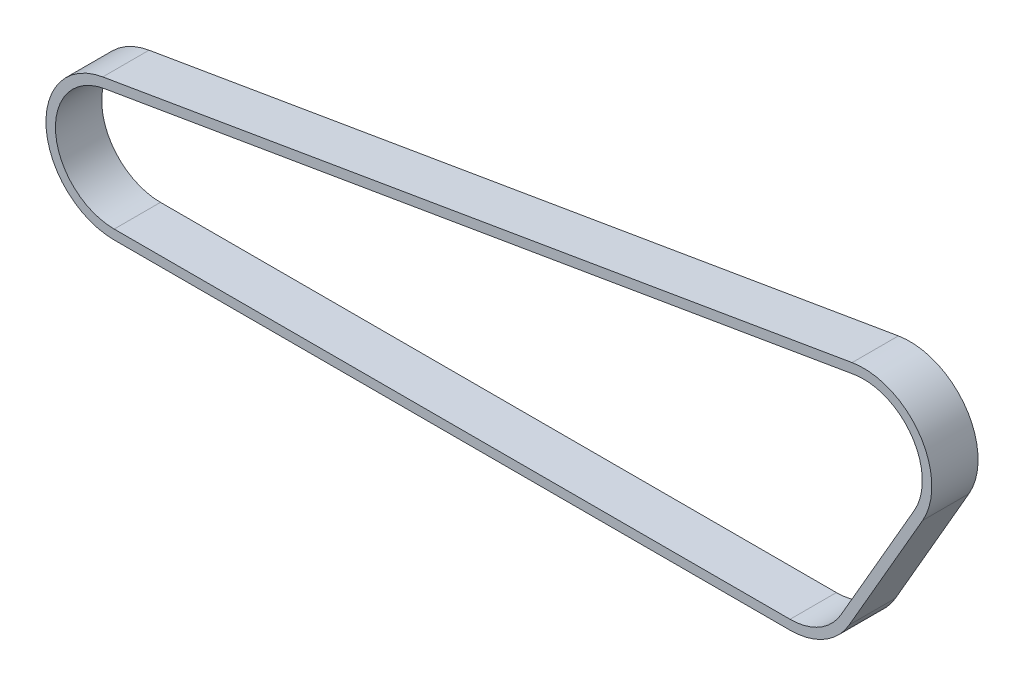
ISO-10303-21;
HEADER;
FILE_DESCRIPTION(('STEP AP214'),'2;1');
FILE_NAME('part.step','',(''),(''),'','','');
FILE_SCHEMA(('AUTOMOTIVE_DESIGN { 1 0 10303 214 1 1 1 1 }'));
ENDSEC;
DATA;
#1=APPLICATION_CONTEXT('core data for automotive mechanical design processes');
#2=APPLICATION_PROTOCOL_DEFINITION('international standard','automotive_design',2000,#1);
#3=PRODUCT_CONTEXT('',#1,'mechanical');
#4=PRODUCT('Part','Part','',(#3));
#5=PRODUCT_RELATED_PRODUCT_CATEGORY('part','',(#4));
#6=PRODUCT_DEFINITION_FORMATION('','',#4);
#7=PRODUCT_DEFINITION_CONTEXT('part definition',#1,'design');
#8=PRODUCT_DEFINITION('design','',#6,#7);
#9=PRODUCT_DEFINITION_SHAPE('','',#8);
#10=(LENGTH_UNIT() NAMED_UNIT(*) SI_UNIT(.MILLI.,.METRE.));
#11=(NAMED_UNIT(*) PLANE_ANGLE_UNIT() SI_UNIT($,.RADIAN.));
#12=(NAMED_UNIT(*) SI_UNIT($,.STERADIAN.) SOLID_ANGLE_UNIT());
#13=UNCERTAINTY_MEASURE_WITH_UNIT(LENGTH_MEASURE(1.E-05),#10,'distance_accuracy_value','');
#14=(GEOMETRIC_REPRESENTATION_CONTEXT(3) GLOBAL_UNCERTAINTY_ASSIGNED_CONTEXT((#13)) GLOBAL_UNIT_ASSIGNED_CONTEXT((#10,
#11,#12)) REPRESENTATION_CONTEXT('',''));
#15=CARTESIAN_POINT('',(0.,0.,0.));
#16=DIRECTION('',(0.,0.,1.));
#17=DIRECTION('',(1.,0.,0.));
#18=AXIS2_PLACEMENT_3D('',#15,#16,#17);
#19=CARTESIAN_POINT('',(-323.85,-54.992613140312,10.));
#20=DIRECTION('',(0.,0.,1.));
#21=DIRECTION('',(1.,0.,0.));
#22=AXIS2_PLACEMENT_3D('',#19,#20,#21);
#23=PLANE('',#22);
#24=CARTESIAN_POINT('',(-323.85,-54.992613140312,10.));
#25=DIRECTION('',(0.,0.,1.));
#26=DIRECTION('',(1.,0.,0.));
#27=AXIS2_PLACEMENT_3D('',#24,#25,#26);
#28=CIRCLE('',#27,29.5);
#29=CARTESIAN_POINT('',(-328.788665285095,-25.9089478760817,10.));
#30=VERTEX_POINT('',#29);
#31=CARTESIAN_POINT('',(-323.85,-84.4926131403119,10.));
#32=VERTEX_POINT('',#31);
#33=EDGE_CURVE('E174',#30,#32,#28,.T.);
#34=ORIENTED_EDGE('',*,*,#33,.T.);
#35=DIRECTION('',(1.,0.,0.));
#36=VECTOR('',#35,1.);
#37=CARTESIAN_POINT('',(-31.7499999999999,-84.4926131403119,10.));
#38=LINE('',#37,#36);
#39=CARTESIAN_POINT('',(-31.7499999999999,-84.4926131403119,10.));
#40=VERTEX_POINT('',#39);
#41=EDGE_CURVE('E177',#32,#40,#38,.T.);
#42=ORIENTED_EDGE('',*,*,#41,.T.);
#43=CARTESIAN_POINT('',(-31.7499999999999,-54.9926131403119,10.));
#44=DIRECTION('',(0.,0.,1.));
#45=DIRECTION('',(1.,0.,0.));
#46=AXIS2_PLACEMENT_3D('',#43,#44,#45);
#47=CIRCLE('',#46,29.5);
#48=CARTESIAN_POINT('',(-6.2022505883589,-69.7426131403119,10.));
#49=VERTEX_POINT('',#48);
#50=EDGE_CURVE('E180',#40,#49,#47,.T.);
#51=ORIENTED_EDGE('',*,*,#50,.T.);
#52=DIRECTION('',(0.499999999999998,0.86602540378444,0.));
#53=VECTOR('',#52,1.);
#54=CARTESIAN_POINT('',(25.547749411641,-14.7499999999999,10.));
#55=LINE('',#54,#53);
#56=CARTESIAN_POINT('',(25.547749411641,-14.7499999999999,10.));
#57=VERTEX_POINT('',#56);
#58=EDGE_CURVE('E182',#49,#57,#55,.T.);
#59=ORIENTED_EDGE('',*,*,#58,.T.);
#60=CARTESIAN_POINT('',(0.,0.,10.));
#61=DIRECTION('',(0.,0.,1.));
#62=DIRECTION('',(1.,0.,0.));
#63=AXIS2_PLACEMENT_3D('',#60,#61,#62);
#64=CIRCLE('',#63,29.5);
#65=CARTESIAN_POINT('',(-4.93866528509543,29.0836652642302,10.));
#66=VERTEX_POINT('',#65);
#67=EDGE_CURVE('E184',#57,#66,#64,.T.);
#68=ORIENTED_EDGE('',*,*,#67,.T.);
#69=DIRECTION('',(-0.9858869581095,-0.167412382545607,0.));
#70=VECTOR('',#69,1.);
#71=CARTESIAN_POINT('',(-328.788665285095,-25.9089478760817,10.));
#72=LINE('',#71,#70);
#73=EDGE_CURVE('E186',#66,#30,#72,.T.);
#74=ORIENTED_EDGE('',*,*,#73,.T.);
#75=EDGE_LOOP('',(#34,#42,#51,#59,#68,#74));
#76=FACE_BOUND('',#75,.T.);
#77=DIRECTION('',(1.,0.,0.));
#78=VECTOR('',#77,1.);
#79=CARTESIAN_POINT('',(-31.7499999999999,-80.3926131403119,10.));
#80=LINE('',#79,#78);
#81=CARTESIAN_POINT('',(-323.85,-80.392613140312,10.));
#82=VERTEX_POINT('',#81);
#83=CARTESIAN_POINT('',(-31.7499999999999,-80.3926131403119,10.));
#84=VERTEX_POINT('',#83);
#85=EDGE_CURVE('E131',#82,#84,#80,.T.);
#86=ORIENTED_EDGE('',*,*,#85,.F.);
#87=CARTESIAN_POINT('',(-323.85,-54.992613140312,10.));
#88=DIRECTION('',(0.,0.,1.));
#89=DIRECTION('',(1.,0.,0.));
#90=AXIS2_PLACEMENT_3D('',#87,#88,#89);
#91=CIRCLE('',#90,25.4);
#92=CARTESIAN_POINT('',(-328.102274516658,-29.9510844043306,10.));
#93=VERTEX_POINT('',#92);
#94=EDGE_CURVE('E123',#93,#82,#91,.T.);
#95=ORIENTED_EDGE('',*,*,#94,.F.);
#96=DIRECTION('',(-0.9858869581095,-0.167412382545607,0.));
#97=VECTOR('',#96,1.);
#98=CARTESIAN_POINT('',(-328.102274516658,-29.9510844043306,10.));
#99=LINE('',#98,#97);
#100=CARTESIAN_POINT('',(-4.25227451665838,25.0415287359813,10.));
#101=VERTEX_POINT('',#100);
#102=EDGE_CURVE('E152',#101,#93,#99,.T.);
#103=ORIENTED_EDGE('',*,*,#102,.F.);
#104=CARTESIAN_POINT('',(0.,0.,10.));
#105=DIRECTION('',(0.,0.,1.));
#106=DIRECTION('',(1.,0.,0.));
#107=AXIS2_PLACEMENT_3D('',#104,#105,#106);
#108=CIRCLE('',#107,25.4);
#109=CARTESIAN_POINT('',(21.9970452561248,-12.7,10.));
#110=VERTEX_POINT('',#109);
#111=EDGE_CURVE('E150',#110,#101,#108,.T.);
#112=ORIENTED_EDGE('',*,*,#111,.F.);
#113=DIRECTION('',(0.499999999999998,0.86602540378444,0.));
#114=VECTOR('',#113,1.);
#115=CARTESIAN_POINT('',(21.9970452561248,-12.6999999999999,10.));
#116=LINE('',#115,#114);
#117=CARTESIAN_POINT('',(-9.7529547438751,-67.6926131403119,10.));
#118=VERTEX_POINT('',#117);
#119=EDGE_CURVE('E146',#118,#110,#116,.T.);
#120=ORIENTED_EDGE('',*,*,#119,.F.);
#121=CARTESIAN_POINT('',(-31.7499999999999,-54.9926131403119,10.));
#122=DIRECTION('',(0.,0.,1.));
#123=DIRECTION('',(1.,0.,0.));
#124=AXIS2_PLACEMENT_3D('',#121,#122,#123);
#125=CIRCLE('',#124,25.4);
#126=EDGE_CURVE('E144',#84,#118,#125,.T.);
#127=ORIENTED_EDGE('',*,*,#126,.F.);
#128=EDGE_LOOP('',(#86,#95,#103,#112,#120,#127));
#129=FACE_BOUND('',#128,.T.);
#130=ADVANCED_FACE('F34',(#76,#129),#23,.T.);
#131=CARTESIAN_POINT('',(-323.85,-54.992613140312,-10.));
#132=DIRECTION('',(0.,0.,1.));
#133=DIRECTION('',(1.,0.,0.));
#134=AXIS2_PLACEMENT_3D('',#131,#132,#133);
#135=PLANE('',#134);
#136=CARTESIAN_POINT('',(-323.85,-54.992613140312,-10.));
#137=DIRECTION('',(0.,0.,1.));
#138=DIRECTION('',(1.,0.,0.));
#139=AXIS2_PLACEMENT_3D('',#136,#137,#138);
#140=CIRCLE('',#139,29.5);
#141=CARTESIAN_POINT('',(-328.788665285095,-25.9089478760817,-10.));
#142=VERTEX_POINT('',#141);
#143=CARTESIAN_POINT('',(-323.85,-84.4926131403119,-10.));
#144=VERTEX_POINT('',#143);
#145=EDGE_CURVE('E139',#142,#144,#140,.T.);
#146=ORIENTED_EDGE('',*,*,#145,.F.);
#147=DIRECTION('',(-0.9858869581095,-0.167412382545607,0.));
#148=VECTOR('',#147,1.);
#149=CARTESIAN_POINT('',(-328.788665285095,-25.9089478760817,-10.));
#150=LINE('',#149,#148);
#151=CARTESIAN_POINT('',(-4.93866528509543,29.0836652642302,-10.));
#152=VERTEX_POINT('',#151);
#153=EDGE_CURVE('E178',#152,#142,#150,.T.);
#154=ORIENTED_EDGE('',*,*,#153,.F.);
#155=CARTESIAN_POINT('',(0.,0.,-10.));
#156=DIRECTION('',(0.,0.,1.));
#157=DIRECTION('',(1.,0.,0.));
#158=AXIS2_PLACEMENT_3D('',#155,#156,#157);
#159=CIRCLE('',#158,29.5);
#160=CARTESIAN_POINT('',(25.547749411641,-14.7499999999999,-10.));
#161=VERTEX_POINT('',#160);
#162=EDGE_CURVE('E197',#161,#152,#159,.T.);
#163=ORIENTED_EDGE('',*,*,#162,.F.);
#164=DIRECTION('',(0.499999999999998,0.86602540378444,0.));
#165=VECTOR('',#164,1.);
#166=CARTESIAN_POINT('',(25.547749411641,-14.7499999999999,-10.));
#167=LINE('',#166,#165);
#168=CARTESIAN_POINT('',(-6.2022505883589,-69.7426131403119,-10.));
#169=VERTEX_POINT('',#168);
#170=EDGE_CURVE('E195',#169,#161,#167,.T.);
#171=ORIENTED_EDGE('',*,*,#170,.F.);
#172=CARTESIAN_POINT('',(-31.7499999999999,-54.9926131403119,-10.));
#173=DIRECTION('',(0.,0.,1.));
#174=DIRECTION('',(1.,0.,0.));
#175=AXIS2_PLACEMENT_3D('',#172,#173,#174);
#176=CIRCLE('',#175,29.5);
#177=CARTESIAN_POINT('',(-31.7499999999999,-84.4926131403119,-10.));
#178=VERTEX_POINT('',#177);
#179=EDGE_CURVE('E193',#178,#169,#176,.T.);
#180=ORIENTED_EDGE('',*,*,#179,.F.);
#181=DIRECTION('',(1.,0.,0.));
#182=VECTOR('',#181,1.);
#183=CARTESIAN_POINT('',(-31.7499999999999,-84.4926131403119,-10.));
#184=LINE('',#183,#182);
#185=EDGE_CURVE('E191',#144,#178,#184,.T.);
#186=ORIENTED_EDGE('',*,*,#185,.F.);
#187=EDGE_LOOP('',(#146,#154,#163,#171,#180,#186));
#188=FACE_BOUND('',#187,.T.);
#189=CARTESIAN_POINT('',(-323.85,-54.992613140312,-10.));
#190=DIRECTION('',(0.,0.,1.));
#191=DIRECTION('',(1.,0.,0.));
#192=AXIS2_PLACEMENT_3D('',#189,#190,#191);
#193=CIRCLE('',#192,25.4);
#194=CARTESIAN_POINT('',(-328.102274516658,-29.9510844043306,-10.));
#195=VERTEX_POINT('',#194);
#196=CARTESIAN_POINT('',(-323.85,-80.392613140312,-10.));
#197=VERTEX_POINT('',#196);
#198=EDGE_CURVE('E57',#195,#197,#193,.T.);
#199=ORIENTED_EDGE('',*,*,#198,.T.);
#200=DIRECTION('',(1.,0.,0.));
#201=VECTOR('',#200,1.);
#202=CARTESIAN_POINT('',(-31.7499999999999,-80.3926131403119,-10.));
#203=LINE('',#202,#201);
#204=CARTESIAN_POINT('',(-31.7499999999999,-80.3926131403119,-10.));
#205=VERTEX_POINT('',#204);
#206=EDGE_CURVE('E138',#197,#205,#203,.T.);
#207=ORIENTED_EDGE('',*,*,#206,.T.);
#208=CARTESIAN_POINT('',(-31.7499999999999,-54.9926131403119,-10.));
#209=DIRECTION('',(0.,0.,1.));
#210=DIRECTION('',(1.,0.,0.));
#211=AXIS2_PLACEMENT_3D('',#208,#209,#210);
#212=CIRCLE('',#211,25.4);
#213=CARTESIAN_POINT('',(-9.7529547438751,-67.6926131403119,-10.));
#214=VERTEX_POINT('',#213);
#215=EDGE_CURVE('E156',#205,#214,#212,.T.);
#216=ORIENTED_EDGE('',*,*,#215,.T.);
#217=DIRECTION('',(0.499999999999998,0.86602540378444,0.));
#218=VECTOR('',#217,1.);
#219=CARTESIAN_POINT('',(21.9970452561248,-12.6999999999999,-10.));
#220=LINE('',#219,#218);
#221=CARTESIAN_POINT('',(21.9970452561248,-12.7,-10.));
#222=VERTEX_POINT('',#221);
#223=EDGE_CURVE('E159',#214,#222,#220,.T.);
#224=ORIENTED_EDGE('',*,*,#223,.T.);
#225=CARTESIAN_POINT('',(0.,0.,-10.));
#226=DIRECTION('',(0.,0.,1.));
#227=DIRECTION('',(1.,0.,0.));
#228=AXIS2_PLACEMENT_3D('',#225,#226,#227);
#229=CIRCLE('',#228,25.4);
#230=CARTESIAN_POINT('',(-4.25227451665839,25.0415287359813,-10.));
#231=VERTEX_POINT('',#230);
#232=EDGE_CURVE('E162',#222,#231,#229,.T.);
#233=ORIENTED_EDGE('',*,*,#232,.T.);
#234=DIRECTION('',(-0.9858869581095,-0.167412382545607,0.));
#235=VECTOR('',#234,1.);
#236=CARTESIAN_POINT('',(-328.102274516658,-29.9510844043306,-10.));
#237=LINE('',#236,#235);
#238=EDGE_CURVE('E132',#231,#195,#237,.T.);
#239=ORIENTED_EDGE('',*,*,#238,.T.);
#240=EDGE_LOOP('',(#199,#207,#216,#224,#233,#239));
#241=FACE_BOUND('',#240,.T.);
#242=ADVANCED_FACE('F221',(#188,#241),#135,.F.);
#243=CARTESIAN_POINT('',(-323.85,-54.992613140312,10.));
#244=DIRECTION('',(0.,0.,-1.));
#245=DIRECTION('',(-1.,0.,0.));
#246=AXIS2_PLACEMENT_3D('',#243,#244,#245);
#247=CYLINDRICAL_SURFACE('',#246,29.5);
#248=ORIENTED_EDGE('',*,*,#145,.T.);
#249=DIRECTION('',(0.,0.,-1.));
#250=VECTOR('',#249,1.);
#251=CARTESIAN_POINT('',(-323.85,-84.4926131403119,10.));
#252=LINE('',#251,#250);
#253=EDGE_CURVE('E11',#32,#144,#252,.T.);
#254=ORIENTED_EDGE('',*,*,#253,.F.);
#255=ORIENTED_EDGE('',*,*,#33,.F.);
#256=DIRECTION('',(0.,0.,-1.));
#257=VECTOR('',#256,1.);
#258=CARTESIAN_POINT('',(-328.788665285095,-25.9089478760817,10.));
#259=LINE('',#258,#257);
#260=EDGE_CURVE('E188',#30,#142,#259,.T.);
#261=ORIENTED_EDGE('',*,*,#260,.T.);
#262=EDGE_LOOP('',(#248,#254,#255,#261));
#263=FACE_BOUND('',#262,.T.);
#264=ADVANCED_FACE('F36',(#263),#247,.T.);
#265=CARTESIAN_POINT('',(-31.7499999999999,-84.4926131403119,10.));
#266=DIRECTION('',(0.,1.,0.));
#267=DIRECTION('',(0.,0.,1.));
#268=AXIS2_PLACEMENT_3D('',#265,#266,#267);
#269=PLANE('',#268);
#270=ORIENTED_EDGE('',*,*,#185,.T.);
#271=DIRECTION('',(0.,0.,-1.));
#272=VECTOR('',#271,1.);
#273=CARTESIAN_POINT('',(-31.7499999999999,-84.4926131403119,10.));
#274=LINE('',#273,#272);
#275=EDGE_CURVE('E42',#40,#178,#274,.T.);
#276=ORIENTED_EDGE('',*,*,#275,.F.);
#277=ORIENTED_EDGE('',*,*,#41,.F.);
#278=ORIENTED_EDGE('',*,*,#253,.T.);
#279=EDGE_LOOP('',(#270,#276,#277,#278));
#280=FACE_BOUND('',#279,.T.);
#281=ADVANCED_FACE('F238',(#280),#269,.F.);
#282=CARTESIAN_POINT('',(-31.7499999999999,-54.9926131403119,10.));
#283=DIRECTION('',(0.,0.,-1.));
#284=DIRECTION('',(-1.,0.,0.));
#285=AXIS2_PLACEMENT_3D('',#282,#283,#284);
#286=CYLINDRICAL_SURFACE('',#285,29.5);
#287=ORIENTED_EDGE('',*,*,#179,.T.);
#288=DIRECTION('',(0.,0.,-1.));
#289=VECTOR('',#288,1.);
#290=CARTESIAN_POINT('',(-6.2022505883589,-69.7426131403119,10.));
#291=LINE('',#290,#289);
#292=EDGE_CURVE('E208',#49,#169,#291,.T.);
#293=ORIENTED_EDGE('',*,*,#292,.F.);
#294=ORIENTED_EDGE('',*,*,#50,.F.);
#295=ORIENTED_EDGE('',*,*,#275,.T.);
#296=EDGE_LOOP('',(#287,#293,#294,#295));
#297=FACE_BOUND('',#296,.T.);
#298=ADVANCED_FACE('F215',(#297),#286,.T.);
#299=CARTESIAN_POINT('',(25.547749411641,-14.7499999999999,10.));
#300=DIRECTION('',(-0.86602540378444,0.499999999999998,0.));
#301=DIRECTION('',(-0.499999999999998,-0.86602540378444,0.));
#302=AXIS2_PLACEMENT_3D('',#299,#300,#301);
#303=PLANE('',#302);
#304=ORIENTED_EDGE('',*,*,#170,.T.);
#305=DIRECTION('',(0.,0.,-1.));
#306=VECTOR('',#305,1.);
#307=CARTESIAN_POINT('',(25.547749411641,-14.7499999999999,10.));
#308=LINE('',#307,#306);
#309=EDGE_CURVE('E205',#57,#161,#308,.T.);
#310=ORIENTED_EDGE('',*,*,#309,.F.);
#311=ORIENTED_EDGE('',*,*,#58,.F.);
#312=ORIENTED_EDGE('',*,*,#292,.T.);
#313=EDGE_LOOP('',(#304,#310,#311,#312));
#314=FACE_BOUND('',#313,.T.);
#315=ADVANCED_FACE('F227',(#314),#303,.F.);
#316=CARTESIAN_POINT('',(0.,0.,10.));
#317=DIRECTION('',(0.,0.,-1.));
#318=DIRECTION('',(-1.,0.,0.));
#319=AXIS2_PLACEMENT_3D('',#316,#317,#318);
#320=CYLINDRICAL_SURFACE('',#319,29.5);
#321=ORIENTED_EDGE('',*,*,#162,.T.);
#322=DIRECTION('',(0.,0.,-1.));
#323=VECTOR('',#322,1.);
#324=CARTESIAN_POINT('',(-4.93866528509543,29.0836652642302,10.));
#325=LINE('',#324,#323);
#326=EDGE_CURVE('E202',#66,#152,#325,.T.);
#327=ORIENTED_EDGE('',*,*,#326,.F.);
#328=ORIENTED_EDGE('',*,*,#67,.F.);
#329=ORIENTED_EDGE('',*,*,#309,.T.);
#330=EDGE_LOOP('',(#321,#327,#328,#329));
#331=FACE_BOUND('',#330,.T.);
#332=ADVANCED_FACE('F231',(#331),#320,.T.);
#333=CARTESIAN_POINT('',(-328.788665285095,-25.9089478760817,10.));
#334=DIRECTION('',(0.167412382545607,-0.9858869581095,0.));
#335=DIRECTION('',(0.9858869581095,0.167412382545607,0.));
#336=AXIS2_PLACEMENT_3D('',#333,#334,#335);
#337=PLANE('',#336);
#338=ORIENTED_EDGE('',*,*,#153,.T.);
#339=ORIENTED_EDGE('',*,*,#260,.F.);
#340=ORIENTED_EDGE('',*,*,#73,.F.);
#341=ORIENTED_EDGE('',*,*,#326,.T.);
#342=EDGE_LOOP('',(#338,#339,#340,#341));
#343=FACE_BOUND('',#342,.T.);
#344=ADVANCED_FACE('F241',(#343),#337,.F.);
#345=CARTESIAN_POINT('',(-323.85,-54.992613140312,10.));
#346=DIRECTION('',(0.,0.,-1.));
#347=DIRECTION('',(-1.,0.,0.));
#348=AXIS2_PLACEMENT_3D('',#345,#346,#347);
#349=CYLINDRICAL_SURFACE('',#348,25.4);
#350=ORIENTED_EDGE('',*,*,#198,.F.);
#351=DIRECTION('',(0.,0.,-1.));
#352=VECTOR('',#351,1.);
#353=CARTESIAN_POINT('',(-328.102274516658,-29.9510844043306,10.));
#354=LINE('',#353,#352);
#355=EDGE_CURVE('E127',#93,#195,#354,.T.);
#356=ORIENTED_EDGE('',*,*,#355,.F.);
#357=ORIENTED_EDGE('',*,*,#94,.T.);
#358=DIRECTION('',(0.,0.,-1.));
#359=VECTOR('',#358,1.);
#360=CARTESIAN_POINT('',(-323.85,-80.392613140312,10.));
#361=LINE('',#360,#359);
#362=EDGE_CURVE('E126',#82,#197,#361,.T.);
#363=ORIENTED_EDGE('',*,*,#362,.T.);
#364=EDGE_LOOP('',(#350,#356,#357,#363));
#365=FACE_BOUND('',#364,.T.);
#366=ADVANCED_FACE('F125',(#365),#349,.F.);
#367=CARTESIAN_POINT('',(-31.7499999999999,-80.3926131403119,10.));
#368=DIRECTION('',(0.,1.,0.));
#369=DIRECTION('',(-1.,0.,0.));
#370=AXIS2_PLACEMENT_3D('',#367,#368,#369);
#371=PLANE('',#370);
#372=ORIENTED_EDGE('',*,*,#206,.F.);
#373=ORIENTED_EDGE('',*,*,#362,.F.);
#374=ORIENTED_EDGE('',*,*,#85,.T.);
#375=DIRECTION('',(0.,0.,-1.));
#376=VECTOR('',#375,1.);
#377=CARTESIAN_POINT('',(-31.7499999999999,-80.3926131403119,10.));
#378=LINE('',#377,#376);
#379=EDGE_CURVE('E140',#84,#205,#378,.T.);
#380=ORIENTED_EDGE('',*,*,#379,.T.);
#381=EDGE_LOOP('',(#372,#373,#374,#380));
#382=FACE_BOUND('',#381,.T.);
#383=ADVANCED_FACE('F135',(#382),#371,.T.);
#384=CARTESIAN_POINT('',(-31.7499999999999,-54.9926131403119,10.));
#385=DIRECTION('',(0.,0.,-1.));
#386=DIRECTION('',(-1.,0.,0.));
#387=AXIS2_PLACEMENT_3D('',#384,#385,#386);
#388=CYLINDRICAL_SURFACE('',#387,25.4);
#389=ORIENTED_EDGE('',*,*,#215,.F.);
#390=ORIENTED_EDGE('',*,*,#379,.F.);
#391=ORIENTED_EDGE('',*,*,#126,.T.);
#392=DIRECTION('',(0.,0.,-1.));
#393=VECTOR('',#392,1.);
#394=CARTESIAN_POINT('',(-9.7529547438751,-67.6926131403119,10.));
#395=LINE('',#394,#393);
#396=EDGE_CURVE('E171',#118,#214,#395,.T.);
#397=ORIENTED_EDGE('',*,*,#396,.T.);
#398=EDGE_LOOP('',(#389,#390,#391,#397));
#399=FACE_BOUND('',#398,.T.);
#400=ADVANCED_FACE('F259',(#399),#388,.F.);
#401=CARTESIAN_POINT('',(21.9970452561248,-12.6999999999999,10.));
#402=DIRECTION('',(-0.86602540378444,0.499999999999998,0.));
#403=DIRECTION('',(-0.499999999999998,-0.86602540378444,0.));
#404=AXIS2_PLACEMENT_3D('',#401,#402,#403);
#405=PLANE('',#404);
#406=ORIENTED_EDGE('',*,*,#223,.F.);
#407=ORIENTED_EDGE('',*,*,#396,.F.);
#408=ORIENTED_EDGE('',*,*,#119,.T.);
#409=DIRECTION('',(0.,0.,-1.));
#410=VECTOR('',#409,1.);
#411=CARTESIAN_POINT('',(21.9970452561248,-12.7,10.));
#412=LINE('',#411,#410);
#413=EDGE_CURVE('E169',#110,#222,#412,.T.);
#414=ORIENTED_EDGE('',*,*,#413,.T.);
#415=EDGE_LOOP('',(#406,#407,#408,#414));
#416=FACE_BOUND('',#415,.T.);
#417=ADVANCED_FACE('F262',(#416),#405,.T.);
#418=CARTESIAN_POINT('',(0.,0.,10.));
#419=DIRECTION('',(0.,0.,-1.));
#420=DIRECTION('',(-1.,0.,0.));
#421=AXIS2_PLACEMENT_3D('',#418,#419,#420);
#422=CYLINDRICAL_SURFACE('',#421,25.4);
#423=ORIENTED_EDGE('',*,*,#232,.F.);
#424=ORIENTED_EDGE('',*,*,#413,.F.);
#425=ORIENTED_EDGE('',*,*,#111,.T.);
#426=DIRECTION('',(0.,0.,-1.));
#427=VECTOR('',#426,1.);
#428=CARTESIAN_POINT('',(-4.25227451665839,25.0415287359813,10.));
#429=LINE('',#428,#427);
#430=EDGE_CURVE('E49',#101,#231,#429,.T.);
#431=ORIENTED_EDGE('',*,*,#430,.T.);
#432=EDGE_LOOP('',(#423,#424,#425,#431));
#433=FACE_BOUND('',#432,.T.);
#434=ADVANCED_FACE('F266',(#433),#422,.F.);
#435=CARTESIAN_POINT('',(-328.102274516658,-29.9510844043306,10.));
#436=DIRECTION('',(0.167412382545607,-0.9858869581095,0.));
#437=DIRECTION('',(0.9858869581095,0.167412382545607,0.));
#438=AXIS2_PLACEMENT_3D('',#435,#436,#437);
#439=PLANE('',#438);
#440=ORIENTED_EDGE('',*,*,#238,.F.);
#441=ORIENTED_EDGE('',*,*,#430,.F.);
#442=ORIENTED_EDGE('',*,*,#102,.T.);
#443=ORIENTED_EDGE('',*,*,#355,.T.);
#444=EDGE_LOOP('',(#440,#441,#442,#443));
#445=FACE_BOUND('',#444,.T.);
#446=ADVANCED_FACE('F270',(#445),#439,.T.);
#447=CLOSED_SHELL('',(#130,#242,#264,#281,#298,#315,#332,#344,#366,#383,#400,#417,#434,#446));
#448=MANIFOLD_SOLID_BREP('B2',#447);
#449=ADVANCED_BREP_SHAPE_REPRESENTATION('',(#18,#448),#14);
#450=SHAPE_DEFINITION_REPRESENTATION(#9,#449);
ENDSEC;
END-ISO-10303-21;
